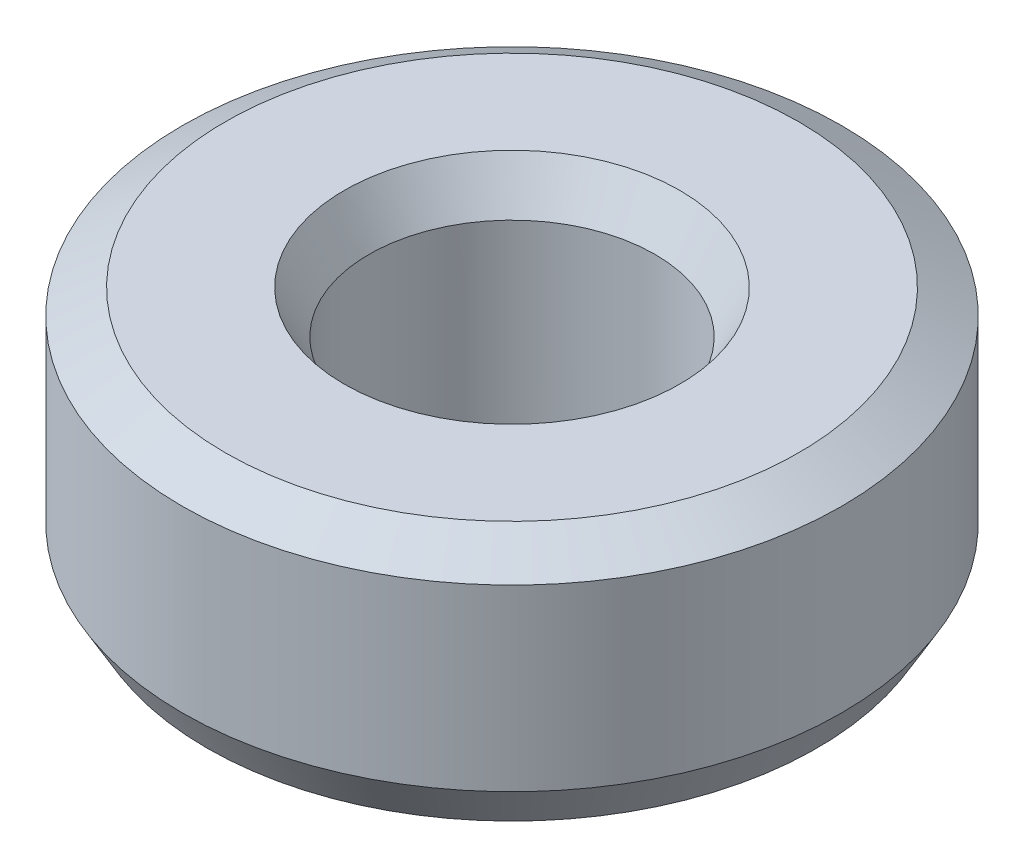
ISO-10303-21;
HEADER;
FILE_DESCRIPTION(('STEP AP214'),'2;1');
FILE_NAME('part.step','',(''),(''),'','','');
FILE_SCHEMA(('AUTOMOTIVE_DESIGN { 1 0 10303 214 1 1 1 1 }'));
ENDSEC;
DATA;
#1=APPLICATION_CONTEXT('core data for automotive mechanical design processes');
#2=APPLICATION_PROTOCOL_DEFINITION('international standard','automotive_design',2000,#1);
#3=PRODUCT_CONTEXT('',#1,'mechanical');
#4=PRODUCT('Part','Part','',(#3));
#5=PRODUCT_RELATED_PRODUCT_CATEGORY('part','',(#4));
#6=PRODUCT_DEFINITION_FORMATION('','',#4);
#7=PRODUCT_DEFINITION_CONTEXT('part definition',#1,'design');
#8=PRODUCT_DEFINITION('design','',#6,#7);
#9=PRODUCT_DEFINITION_SHAPE('','',#8);
#10=(LENGTH_UNIT() NAMED_UNIT(*) SI_UNIT(.MILLI.,.METRE.));
#11=(NAMED_UNIT(*) PLANE_ANGLE_UNIT() SI_UNIT($,.RADIAN.));
#12=(NAMED_UNIT(*) SI_UNIT($,.STERADIAN.) SOLID_ANGLE_UNIT());
#13=UNCERTAINTY_MEASURE_WITH_UNIT(LENGTH_MEASURE(1.E-05),#10,'distance_accuracy_value','');
#14=(GEOMETRIC_REPRESENTATION_CONTEXT(3) GLOBAL_UNCERTAINTY_ASSIGNED_CONTEXT((#13)) GLOBAL_UNIT_ASSIGNED_CONTEXT((#10,
#11,#12)) REPRESENTATION_CONTEXT('',''));
#15=CARTESIAN_POINT('',(0.,0.,0.));
#16=DIRECTION('',(0.,0.,1.));
#17=DIRECTION('',(1.,0.,0.));
#18=AXIS2_PLACEMENT_3D('',#15,#16,#17);
#19=CARTESIAN_POINT('',(0.,28.06680075367,0.));
#20=DIRECTION('',(0.,-1.,0.));
#21=DIRECTION('',(0.,0.,-1.));
#22=AXIS2_PLACEMENT_3D('',#19,#20,#21);
#23=CYLINDRICAL_SURFACE('',#22,37.5);
#24=CARTESIAN_POINT('',(0.,4.88955479971583,0.));
#25=DIRECTION('',(0.,1.,0.));
#26=DIRECTION('',(0.,0.,1.));
#27=AXIS2_PLACEMENT_3D('',#24,#25,#26);
#28=CIRCLE('',#27,37.5);
#29=CARTESIAN_POINT('',(0.,4.88955479971583,37.5));
#30=VERTEX_POINT('',#29);
#31=EDGE_CURVE('E10',#30,#30,#28,.T.);
#32=ORIENTED_EDGE('',*,*,#31,.T.);
#33=EDGE_LOOP('',(#32));
#34=FACE_BOUND('',#33,.T.);
#35=CARTESIAN_POINT('',(0.,25.2438149738366,0.));
#36=DIRECTION('',(0.,1.,0.));
#37=DIRECTION('',(0.,0.,1.));
#38=AXIS2_PLACEMENT_3D('',#35,#36,#37);
#39=CIRCLE('',#38,37.5);
#40=CARTESIAN_POINT('',(0.,25.2438149738366,37.5));
#41=VERTEX_POINT('',#40);
#42=EDGE_CURVE('E50',#41,#41,#39,.F.);
#43=ORIENTED_EDGE('',*,*,#42,.T.);
#44=EDGE_LOOP('',(#43));
#45=FACE_BOUND('',#44,.T.);
#46=ADVANCED_FACE('F39',(#34,#45),#23,.T.);
#47=CARTESIAN_POINT('',(0.,28.06680075367,0.));
#48=DIRECTION('',(0.,1.,0.));
#49=DIRECTION('',(0.,0.,1.));
#50=AXIS2_PLACEMENT_3D('',#47,#48,#49);
#51=PLANE('',#50);
#52=CARTESIAN_POINT('',(0.,28.06680075367,0.));
#53=DIRECTION('',(0.,1.,0.));
#54=DIRECTION('',(0.,0.,1.));
#55=AXIS2_PLACEMENT_3D('',#52,#53,#54);
#56=CIRCLE('',#55,19.0884110026276);
#57=CARTESIAN_POINT('',(0.,28.06680075367,19.0884110026276));
#58=VERTEX_POINT('',#57);
#59=EDGE_CURVE('E58',#58,#58,#56,.F.);
#60=ORIENTED_EDGE('',*,*,#59,.T.);
#61=EDGE_LOOP('',(#60));
#62=FACE_BOUND('',#61,.T.);
#63=CARTESIAN_POINT('',(0.,28.06680075367,0.));
#64=DIRECTION('',(0.,1.,0.));
#65=DIRECTION('',(0.,0.,1.));
#66=AXIS2_PLACEMENT_3D('',#63,#64,#65);
#67=CIRCLE('',#66,32.6104452002841);
#68=CARTESIAN_POINT('',(0.,28.06680075367,32.6104452002841));
#69=VERTEX_POINT('',#68);
#70=EDGE_CURVE('E61',#69,#69,#67,.T.);
#71=ORIENTED_EDGE('',*,*,#70,.T.);
#72=EDGE_LOOP('',(#71));
#73=FACE_BOUND('',#72,.T.);
#74=ADVANCED_FACE('F88',(#62,#73),#51,.T.);
#75=CARTESIAN_POINT('',(0.,0.,0.));
#76=DIRECTION('',(0.,1.,0.));
#77=DIRECTION('',(0.,0.,1.));
#78=AXIS2_PLACEMENT_3D('',#75,#76,#77);
#79=PLANE('',#78);
#80=CARTESIAN_POINT('',(0.,0.,0.));
#81=DIRECTION('',(0.,1.,0.));
#82=DIRECTION('',(0.,0.,1.));
#83=AXIS2_PLACEMENT_3D('',#80,#81,#82);
#84=CIRCLE('',#83,21.1549800225101);
#85=CARTESIAN_POINT('',(0.,0.,-21.1549800225101));
#86=VERTEX_POINT('',#85);
#87=EDGE_CURVE('E51',#86,#86,#84,.T.);
#88=ORIENTED_EDGE('',*,*,#87,.T.);
#89=EDGE_LOOP('',(#88));
#90=FACE_BOUND('',#89,.T.);
#91=CARTESIAN_POINT('',(0.,0.,0.));
#92=DIRECTION('',(0.,1.,0.));
#93=DIRECTION('',(0.,0.,1.));
#94=AXIS2_PLACEMENT_3D('',#91,#92,#93);
#95=CIRCLE('',#94,34.6770142201666);
#96=CARTESIAN_POINT('',(0.,0.,34.6770142201666));
#97=VERTEX_POINT('',#96);
#98=EDGE_CURVE('E54',#97,#97,#95,.F.);
#99=ORIENTED_EDGE('',*,*,#98,.T.);
#100=EDGE_LOOP('',(#99));
#101=FACE_BOUND('',#100,.T.);
#102=ADVANCED_FACE('F83',(#90,#101),#79,.F.);
#103=CARTESIAN_POINT('',(0.,28.06680075367,0.));
#104=DIRECTION('',(0.,-1.,0.));
#105=DIRECTION('',(0.,0.,-1.));
#106=AXIS2_PLACEMENT_3D('',#103,#104,#105);
#107=CYLINDRICAL_SURFACE('',#106,16.2654252227942);
#108=CARTESIAN_POINT('',(0.,23.1772459539542,0.));
#109=DIRECTION('',(0.,1.,0.));
#110=DIRECTION('',(0.,0.,1.));
#111=AXIS2_PLACEMENT_3D('',#108,#109,#110);
#112=CIRCLE('',#111,16.2654252227942);
#113=CARTESIAN_POINT('',(0.,23.1772459539542,16.2654252227942));
#114=VERTEX_POINT('',#113);
#115=EDGE_CURVE('E67',#114,#114,#112,.T.);
#116=ORIENTED_EDGE('',*,*,#115,.T.);
#117=EDGE_LOOP('',(#116));
#118=FACE_BOUND('',#117,.T.);
#119=CARTESIAN_POINT('',(0.,2.82298577983341,0.));
#120=DIRECTION('',(0.,1.,0.));
#121=DIRECTION('',(0.,0.,1.));
#122=AXIS2_PLACEMENT_3D('',#119,#120,#121);
#123=CIRCLE('',#122,16.2654252227942);
#124=CARTESIAN_POINT('',(0.,2.82298577983341,-16.2654252227942));
#125=VERTEX_POINT('',#124);
#126=EDGE_CURVE('E69',#125,#125,#123,.F.);
#127=ORIENTED_EDGE('',*,*,#126,.T.);
#128=EDGE_LOOP('',(#127));
#129=FACE_BOUND('',#128,.T.);
#130=ADVANCED_FACE('F71',(#118,#129),#107,.F.);
#131=CARTESIAN_POINT('',(0.,23.1772459539542,0.));
#132=DIRECTION('',(0.,1.,0.));
#133=DIRECTION('',(0.,0.,1.));
#134=AXIS2_PLACEMENT_3D('',#131,#132,#133);
#135=CONICAL_SURFACE('',#134,16.2654252227942,0.523598775598301);
#136=ORIENTED_EDGE('',*,*,#59,.F.);
#137=EDGE_LOOP('',(#136));
#138=FACE_BOUND('',#137,.T.);
#139=ORIENTED_EDGE('',*,*,#115,.F.);
#140=EDGE_LOOP('',(#139));
#141=FACE_BOUND('',#140,.T.);
#142=ADVANCED_FACE('F77',(#138,#141),#135,.F.);
#143=CARTESIAN_POINT('',(0.,0.,0.));
#144=DIRECTION('',(0.,-1.,0.));
#145=DIRECTION('',(0.,0.,-1.));
#146=AXIS2_PLACEMENT_3D('',#143,#144,#145);
#147=CONICAL_SURFACE('',#146,21.1549800225101,1.04719755119659);
#148=CARTESIAN_POINT('',(0.,2.82298577983341,-16.2654252227942));
#149=CARTESIAN_POINT('',(0.,2.79357967796014,-16.3163580852912));
#150=CARTESIAN_POINT('',(0.,2.76417357608688,-16.3672909477883));
#151=CARTESIAN_POINT('',(0.,2.70536137234035,-16.4691566727824));
#152=CARTESIAN_POINT('',(0.,2.67595527046709,-16.5200895352794));
#153=CARTESIAN_POINT('',(0.,2.61714306672056,-16.6219552602735));
#154=CARTESIAN_POINT('',(0.,2.58773696484729,-16.6728881227705));
#155=CARTESIAN_POINT('',(0.,2.52892476110076,-16.7747538477646));
#156=CARTESIAN_POINT('',(0.,2.4995186592275,-16.8256867102616));
#157=CARTESIAN_POINT('',(0.,2.44070645548097,-16.9275524352557));
#158=CARTESIAN_POINT('',(0.,2.4113003536077,-16.9784852977528));
#159=CARTESIAN_POINT('',(0.,2.35248814986117,-17.0803510227469));
#160=CARTESIAN_POINT('',(0.,2.32308204798791,-17.1312838852439));
#161=CARTESIAN_POINT('',(0.,2.26426984424138,-17.233149610238));
#162=CARTESIAN_POINT('',(0.,2.23486374236812,-17.284082472735));
#163=CARTESIAN_POINT('',(0.,2.17605153862159,-17.3859481977291));
#164=CARTESIAN_POINT('',(0.,2.14664543674832,-17.4368810602261));
#165=CARTESIAN_POINT('',(0.,2.08783323300179,-17.5387467852202));
#166=CARTESIAN_POINT('',(0.,2.05842713112853,-17.5896796477173));
#167=CARTESIAN_POINT('',(0.,1.999614927382,-17.6915453727113));
#168=CARTESIAN_POINT('',(0.,1.97020882550873,-17.7424782352084));
#169=CARTESIAN_POINT('',(0.,1.9113966217622,-17.8443439602025));
#170=CARTESIAN_POINT('',(0.,1.88199051988894,-17.8952768226995));
#171=CARTESIAN_POINT('',(0.,1.82317831614241,-17.9971425476936));
#172=CARTESIAN_POINT('',(0.,1.79377221426915,-18.0480754101906));
#173=CARTESIAN_POINT('',(0.,1.73496001052262,-18.1499411351847));
#174=CARTESIAN_POINT('',(0.,1.70555390864935,-18.2008739976817));
#175=CARTESIAN_POINT('',(0.,1.64674170490282,-18.3027397226758));
#176=CARTESIAN_POINT('',(0.,1.61733560302956,-18.3536725851729));
#177=CARTESIAN_POINT('',(0.,1.55852339928303,-18.4555383101669));
#178=CARTESIAN_POINT('',(0.,1.52911729740976,-18.506471172664));
#179=CARTESIAN_POINT('',(0.,1.47030509366323,-18.6083368976581));
#180=CARTESIAN_POINT('',(0.,1.44089899178997,-18.6592697601551));
#181=CARTESIAN_POINT('',(0.,1.38208678804344,-18.7611354851492));
#182=CARTESIAN_POINT('',(0.,1.35268068617018,-18.8120683476462));
#183=CARTESIAN_POINT('',(0.,1.29386848242365,-18.9139340726403));
#184=CARTESIAN_POINT('',(0.,1.26446238055038,-18.9648669351373));
#185=CARTESIAN_POINT('',(0.,1.20565017680385,-19.0667326601314));
#186=CARTESIAN_POINT('',(0.,1.17624407493059,-19.1176655226285));
#187=CARTESIAN_POINT('',(0.,1.11743187118406,-19.2195312476225));
#188=CARTESIAN_POINT('',(0.,1.08802576931079,-19.2704641101196));
#189=CARTESIAN_POINT('',(0.,1.02921356556426,-19.3723298351137));
#190=CARTESIAN_POINT('',(0.,0.999807463690999,-19.4232626976107));
#191=CARTESIAN_POINT('',(0.,0.94099525994447,-19.5251284226048));
#192=CARTESIAN_POINT('',(0.,0.911589158071205,-19.5760612851018));
#193=CARTESIAN_POINT('',(0.,0.852776954324675,-19.6779270100959));
#194=CARTESIAN_POINT('',(0.,0.823370852451411,-19.7288598725929));
#195=CARTESIAN_POINT('',(0.,0.764558648704882,-19.830725597587));
#196=CARTESIAN_POINT('',(0.,0.735152546831617,-19.8816584600841));
#197=CARTESIAN_POINT('',(0.,0.676340343085088,-19.9835241850782));
#198=CARTESIAN_POINT('',(0.,0.646934241211823,-20.0344570475752));
#199=CARTESIAN_POINT('',(0.,0.588122037465294,-20.1363227725693));
#200=CARTESIAN_POINT('',(0.,0.558715935592029,-20.1872556350663));
#201=CARTESIAN_POINT('',(0.,0.4999037318455,-20.2891213600604));
#202=CARTESIAN_POINT('',(0.,0.470497629972235,-20.3400542225574));
#203=CARTESIAN_POINT('',(0.,0.411685426225705,-20.4419199475515));
#204=CARTESIAN_POINT('',(0.,0.382279324352441,-20.4928528100486));
#205=CARTESIAN_POINT('',(0.,0.323467120605912,-20.5947185350426));
#206=CARTESIAN_POINT('',(0.,0.294061018732647,-20.6456513975397));
#207=CARTESIAN_POINT('',(0.,0.235248814986117,-20.7475171225338));
#208=CARTESIAN_POINT('',(0.,0.205842713112853,-20.7984499850308));
#209=CARTESIAN_POINT('',(0.,0.147030509366323,-20.9003157100249));
#210=CARTESIAN_POINT('',(0.,0.117624407493059,-20.9512485725219));
#211=CARTESIAN_POINT('',(0.,0.0588122037465293,-21.053114297516));
#212=CARTESIAN_POINT('',(0.,0.0294061018732647,-21.104047160013));
#213=CARTESIAN_POINT('',(0.,0.,-21.1549800225101));
#214=B_SPLINE_CURVE_WITH_KNOTS('',3,(#148,#149,#150,#151,#152,#153,#154,#155,#156,#157,#158,
#159,#160,#161,#162,#163,#164,#165,#166,#167,#168,#169,#170,#171,#172,#173,#174,#175,#176,#177,
#178,#179,#180,#181,#182,#183,#184,#185,#186,#187,#188,#189,#190,#191,#192,#193,#194,#195,#196,
#197,#198,#199,#200,#201,#202,#203,#204,#205,#206,#207,#208,#209,#210,#211,#212,#213),
.UNSPECIFIED.,.F.,.F.,(4,2,2,2,2,2,2,2,2,2,2,2,2,2,2,2,2,2,2,2,2,2,2,2,2,2,2,2,2,2,2,2,4),(0.,
0.176436611239587,0.352873222479174,0.529309833718761,0.705746444958347,0.882183056197934,
1.05861966743752,1.23505627867711,1.41149288991669,1.58792950115628,1.76436611239587,
1.94080272363546,2.11723933487504,2.29367594611463,2.47011255735422,2.64654916859381,
2.82298577983339,2.99942239107298,3.17585900231257,3.35229561355215,3.52873222479174,
3.70516883603133,3.88160544727091,4.0580420585105,4.23447866975009,4.41091528098968,
4.58735189222926,4.76378850346885,4.94022511470844,5.11666172594802,5.29309833718761,
5.4695349484272,5.64597155966679),.UNSPECIFIED.);
#215=EDGE_CURVE('BSEAM73',#125,#86,#214,.T.);
#216=ORIENTED_EDGE('',*,*,#126,.F.);
#217=ORIENTED_EDGE('',*,*,#87,.F.);
#218=ORIENTED_EDGE('',*,*,#215,.T.);
#219=ORIENTED_EDGE('',*,*,#215,.F.);
#220=EDGE_LOOP('',(#216,#218,#217,#219));
#221=FACE_BOUND('',#220,.T.);
#222=ADVANCED_FACE('F73',(#221),#147,.F.);
#223=CARTESIAN_POINT('',(0.,4.88955479971583,0.));
#224=DIRECTION('',(0.,1.,0.));
#225=DIRECTION('',(0.,0.,1.));
#226=AXIS2_PLACEMENT_3D('',#223,#224,#225);
#227=CONICAL_SURFACE('',#226,37.5,0.523598775598302);
#228=ORIENTED_EDGE('',*,*,#98,.F.);
#229=EDGE_LOOP('',(#228));
#230=FACE_BOUND('',#229,.T.);
#231=ORIENTED_EDGE('',*,*,#31,.F.);
#232=EDGE_LOOP('',(#231));
#233=FACE_BOUND('',#232,.T.);
#234=ADVANCED_FACE('F76',(#230,#233),#227,.T.);
#235=CARTESIAN_POINT('',(0.,28.06680075367,0.));
#236=DIRECTION('',(0.,-1.,0.));
#237=DIRECTION('',(0.,0.,-1.));
#238=AXIS2_PLACEMENT_3D('',#235,#236,#237);
#239=CONICAL_SURFACE('',#238,32.6104452002841,1.04719755119659);
#240=ORIENTED_EDGE('',*,*,#42,.F.);
#241=EDGE_LOOP('',(#240));
#242=FACE_BOUND('',#241,.T.);
#243=ORIENTED_EDGE('',*,*,#70,.F.);
#244=EDGE_LOOP('',(#243));
#245=FACE_BOUND('',#244,.T.);
#246=ADVANCED_FACE('F45',(#242,#245),#239,.T.);
#247=CLOSED_SHELL('',(#46,#74,#102,#130,#142,#222,#234,#246));
#248=MANIFOLD_SOLID_BREP('B2',#247);
#249=ADVANCED_BREP_SHAPE_REPRESENTATION('',(#18,#248),#14);
#250=SHAPE_DEFINITION_REPRESENTATION(#9,#249);
ENDSEC;
END-ISO-10303-21;
